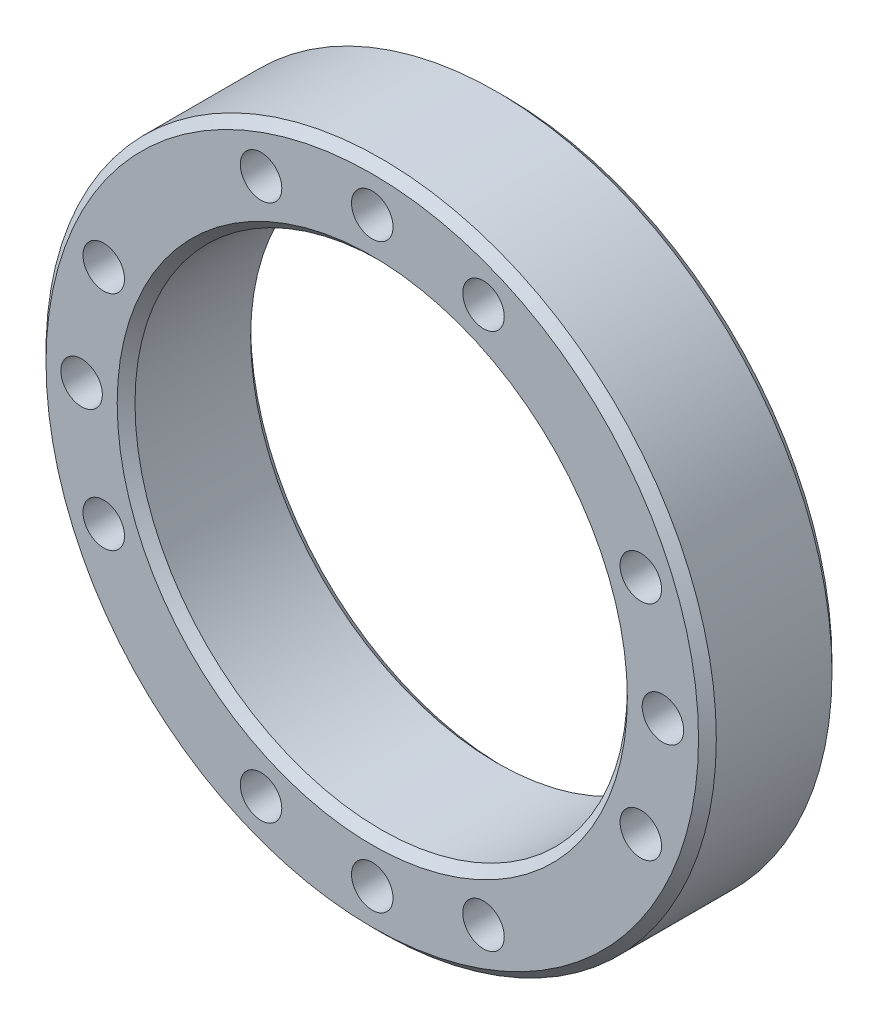
ISO-10303-21;
HEADER;
FILE_DESCRIPTION(('STEP AP214'),'2;1');
FILE_NAME('part.step','',(''),(''),'','','');
FILE_SCHEMA(('AUTOMOTIVE_DESIGN { 1 0 10303 214 1 1 1 1 }'));
ENDSEC;
DATA;
#1=APPLICATION_CONTEXT('core data for automotive mechanical design processes');
#2=APPLICATION_PROTOCOL_DEFINITION('international standard','automotive_design',2000,#1);
#3=PRODUCT_CONTEXT('',#1,'mechanical');
#4=PRODUCT('Part','Part','',(#3));
#5=PRODUCT_RELATED_PRODUCT_CATEGORY('part','',(#4));
#6=PRODUCT_DEFINITION_FORMATION('','',#4);
#7=PRODUCT_DEFINITION_CONTEXT('part definition',#1,'design');
#8=PRODUCT_DEFINITION('design','',#6,#7);
#9=PRODUCT_DEFINITION_SHAPE('','',#8);
#10=(LENGTH_UNIT() NAMED_UNIT(*) SI_UNIT(.MILLI.,.METRE.));
#11=(NAMED_UNIT(*) PLANE_ANGLE_UNIT() SI_UNIT($,.RADIAN.));
#12=(NAMED_UNIT(*) SI_UNIT($,.STERADIAN.) SOLID_ANGLE_UNIT());
#13=UNCERTAINTY_MEASURE_WITH_UNIT(LENGTH_MEASURE(1.E-05),#10,'distance_accuracy_value','');
#14=(GEOMETRIC_REPRESENTATION_CONTEXT(3) GLOBAL_UNCERTAINTY_ASSIGNED_CONTEXT((#13)) GLOBAL_UNIT_ASSIGNED_CONTEXT((#10,
#11,#12)) REPRESENTATION_CONTEXT('',''));
#15=CARTESIAN_POINT('',(0.,0.,0.));
#16=DIRECTION('',(0.,0.,1.));
#17=DIRECTION('',(1.,0.,0.));
#18=AXIS2_PLACEMENT_3D('',#15,#16,#17);
#19=CARTESIAN_POINT('',(0.,0.,22.5));
#20=DIRECTION('',(0.,0.,1.));
#21=DIRECTION('',(1.,0.,0.));
#22=AXIS2_PLACEMENT_3D('',#19,#20,#21);
#23=PLANE('',#22);
#24=CARTESIAN_POINT('',(90.5401941861057,37.5029763717798,22.5));
#25=DIRECTION('',(0.,0.,1.));
#26=DIRECTION('',(1.,0.,0.));
#27=AXIS2_PLACEMENT_3D('',#24,#25,#26);
#28=CIRCLE('',#27,6.99999999999999);
#29=CARTESIAN_POINT('',(97.5401941861057,37.5029763717798,22.5));
#30=VERTEX_POINT('',#29);
#31=EDGE_CURVE('E134',#30,#30,#28,.T.);
#32=ORIENTED_EDGE('',*,*,#31,.F.);
#33=EDGE_LOOP('',(#32));
#34=FACE_BOUND('',#33,.T.);
#35=CARTESIAN_POINT('',(90.5401941861065,-37.5029763717779,22.5));
#36=DIRECTION('',(0.,0.,1.));
#37=DIRECTION('',(1.,0.,0.));
#38=AXIS2_PLACEMENT_3D('',#35,#36,#37);
#39=CIRCLE('',#38,6.99999999999999);
#40=CARTESIAN_POINT('',(97.5401941861065,-37.5029763717779,22.5));
#41=VERTEX_POINT('',#40);
#42=EDGE_CURVE('E128',#41,#41,#39,.T.);
#43=ORIENTED_EDGE('',*,*,#42,.F.);
#44=EDGE_LOOP('',(#43));
#45=FACE_BOUND('',#44,.T.);
#46=CARTESIAN_POINT('',(98.,1.02649551361988E-12,22.5));
#47=DIRECTION('',(0.,0.,1.));
#48=DIRECTION('',(1.,0.,0.));
#49=AXIS2_PLACEMENT_3D('',#46,#47,#48);
#50=CIRCLE('',#49,6.99999999999999);
#51=CARTESIAN_POINT('',(105.,1.02649551361988E-12,22.5));
#52=VERTEX_POINT('',#51);
#53=EDGE_CURVE('E122',#52,#52,#50,.T.);
#54=ORIENTED_EDGE('',*,*,#53,.F.);
#55=EDGE_LOOP('',(#54));
#56=FACE_BOUND('',#55,.T.);
#57=CARTESIAN_POINT('',(37.5029763717789,-90.5401941861061,22.5));
#58=DIRECTION('',(0.,0.,1.));
#59=DIRECTION('',(1.,0.,0.));
#60=AXIS2_PLACEMENT_3D('',#57,#58,#59);
#61=CIRCLE('',#60,6.99999999999999);
#62=CARTESIAN_POINT('',(44.5029763717788,-90.5401941861061,22.5));
#63=VERTEX_POINT('',#62);
#64=EDGE_CURVE('E116',#63,#63,#61,.T.);
#65=ORIENTED_EDGE('',*,*,#64,.F.);
#66=EDGE_LOOP('',(#65));
#67=FACE_BOUND('',#66,.T.);
#68=CARTESIAN_POINT('',(-37.5029763717789,-90.5401941861061,22.5));
#69=DIRECTION('',(0.,0.,1.));
#70=DIRECTION('',(1.,0.,0.));
#71=AXIS2_PLACEMENT_3D('',#68,#69,#70);
#72=CIRCLE('',#71,6.99999999999999);
#73=CARTESIAN_POINT('',(-30.5029763717789,-90.5401941861061,22.5));
#74=VERTEX_POINT('',#73);
#75=EDGE_CURVE('E110',#74,#74,#72,.T.);
#76=ORIENTED_EDGE('',*,*,#75,.F.);
#77=EDGE_LOOP('',(#76));
#78=FACE_BOUND('',#77,.T.);
#79=CARTESIAN_POINT('',(0.,-98.,22.5));
#80=DIRECTION('',(0.,0.,1.));
#81=DIRECTION('',(1.,0.,0.));
#82=AXIS2_PLACEMENT_3D('',#79,#80,#81);
#83=CIRCLE('',#82,6.99999999999999);
#84=CARTESIAN_POINT('',(6.99999999999999,-98.,22.5));
#85=VERTEX_POINT('',#84);
#86=EDGE_CURVE('E104',#85,#85,#83,.T.);
#87=ORIENTED_EDGE('',*,*,#86,.F.);
#88=EDGE_LOOP('',(#87));
#89=FACE_BOUND('',#88,.T.);
#90=CARTESIAN_POINT('',(-90.5401941861059,-37.5029763717792,22.5));
#91=DIRECTION('',(0.,0.,1.));
#92=DIRECTION('',(1.,0.,0.));
#93=AXIS2_PLACEMENT_3D('',#90,#91,#92);
#94=CIRCLE('',#93,6.99999999999999);
#95=CARTESIAN_POINT('',(-83.540194186106,-37.5029763717792,22.5));
#96=VERTEX_POINT('',#95);
#97=EDGE_CURVE('E98',#96,#96,#94,.T.);
#98=ORIENTED_EDGE('',*,*,#97,.F.);
#99=EDGE_LOOP('',(#98));
#100=FACE_BOUND('',#99,.T.);
#101=CARTESIAN_POINT('',(-90.5401941861062,37.5029763717786,22.5));
#102=DIRECTION('',(0.,0.,1.));
#103=DIRECTION('',(1.,0.,0.));
#104=AXIS2_PLACEMENT_3D('',#101,#102,#103);
#105=CIRCLE('',#104,6.99999999999999);
#106=CARTESIAN_POINT('',(-83.5401941861062,37.5029763717786,22.5));
#107=VERTEX_POINT('',#106);
#108=EDGE_CURVE('E92',#107,#107,#105,.T.);
#109=ORIENTED_EDGE('',*,*,#108,.F.);
#110=EDGE_LOOP('',(#109));
#111=FACE_BOUND('',#110,.T.);
#112=CARTESIAN_POINT('',(-98.,-3.42165171206627E-13,22.5));
#113=DIRECTION('',(0.,0.,1.));
#114=DIRECTION('',(1.,0.,0.));
#115=AXIS2_PLACEMENT_3D('',#112,#113,#114);
#116=CIRCLE('',#115,6.99999999999999);
#117=CARTESIAN_POINT('',(-91.,-3.42165171206627E-13,22.5));
#118=VERTEX_POINT('',#117);
#119=EDGE_CURVE('E86',#118,#118,#116,.T.);
#120=ORIENTED_EDGE('',*,*,#119,.F.);
#121=EDGE_LOOP('',(#120));
#122=FACE_BOUND('',#121,.T.);
#123=CARTESIAN_POINT('',(-37.5029763717789,90.5401941861061,22.5));
#124=DIRECTION('',(0.,0.,1.));
#125=DIRECTION('',(1.,0.,0.));
#126=AXIS2_PLACEMENT_3D('',#123,#124,#125);
#127=CIRCLE('',#126,6.99999999999999);
#128=CARTESIAN_POINT('',(-30.5029763717789,90.5401941861061,22.5));
#129=VERTEX_POINT('',#128);
#130=EDGE_CURVE('E80',#129,#129,#127,.T.);
#131=ORIENTED_EDGE('',*,*,#130,.F.);
#132=EDGE_LOOP('',(#131));
#133=FACE_BOUND('',#132,.T.);
#134=CARTESIAN_POINT('',(37.5029763717789,90.5401941861061,22.5));
#135=DIRECTION('',(0.,0.,1.));
#136=DIRECTION('',(1.,0.,0.));
#137=AXIS2_PLACEMENT_3D('',#134,#135,#136);
#138=CIRCLE('',#137,6.99999999999999);
#139=CARTESIAN_POINT('',(44.5029763717789,90.5401941861061,22.5));
#140=VERTEX_POINT('',#139);
#141=EDGE_CURVE('E74',#140,#140,#138,.T.);
#142=ORIENTED_EDGE('',*,*,#141,.F.);
#143=EDGE_LOOP('',(#142));
#144=FACE_BOUND('',#143,.T.);
#145=CARTESIAN_POINT('',(0.,98.,22.5));
#146=DIRECTION('',(0.,0.,1.));
#147=DIRECTION('',(1.,0.,0.));
#148=AXIS2_PLACEMENT_3D('',#145,#146,#147);
#149=CIRCLE('',#148,6.99999999999999);
#150=CARTESIAN_POINT('',(6.99999999999999,98.,22.5));
#151=VERTEX_POINT('',#150);
#152=EDGE_CURVE('E68',#151,#151,#149,.T.);
#153=ORIENTED_EDGE('',*,*,#152,.F.);
#154=EDGE_LOOP('',(#153));
#155=FACE_BOUND('',#154,.T.);
#156=CARTESIAN_POINT('',(0.,0.,22.5));
#157=DIRECTION('',(0.,0.,1.));
#158=DIRECTION('',(1.,0.,0.));
#159=AXIS2_PLACEMENT_3D('',#156,#157,#158);
#160=CIRCLE('',#159,86.0000000000001);
#161=CARTESIAN_POINT('',(86.0000000000001,0.,22.5));
#162=VERTEX_POINT('',#161);
#163=EDGE_CURVE('E44',#162,#162,#160,.F.);
#164=ORIENTED_EDGE('',*,*,#163,.T.);
#165=EDGE_LOOP('',(#164));
#166=FACE_BOUND('',#165,.T.);
#167=CARTESIAN_POINT('',(0.,0.,22.5));
#168=DIRECTION('',(0.,0.,1.));
#169=DIRECTION('',(1.,0.,0.));
#170=AXIS2_PLACEMENT_3D('',#167,#168,#169);
#171=CIRCLE('',#170,110.);
#172=CARTESIAN_POINT('',(110.,0.,22.5));
#173=VERTEX_POINT('',#172);
#174=EDGE_CURVE('E48',#173,#173,#171,.T.);
#175=ORIENTED_EDGE('',*,*,#174,.T.);
#176=EDGE_LOOP('',(#175));
#177=FACE_BOUND('',#176,.T.);
#178=ADVANCED_FACE('F33',(#34,#45,#56,#67,#78,#89,#100,#111,#122,#133,#144,#155,#166,#177),#23,.T.);
#179=CARTESIAN_POINT('',(0.,0.,-22.5));
#180=DIRECTION('',(0.,0.,1.));
#181=DIRECTION('',(1.,0.,0.));
#182=AXIS2_PLACEMENT_3D('',#179,#180,#181);
#183=PLANE('',#182);
#184=CARTESIAN_POINT('',(90.5401941861057,37.5029763717798,-22.5));
#185=DIRECTION('',(0.,0.,1.));
#186=DIRECTION('',(1.,0.,0.));
#187=AXIS2_PLACEMENT_3D('',#184,#185,#186);
#188=CIRCLE('',#187,6.99999999999999);
#189=CARTESIAN_POINT('',(97.5401941861057,37.5029763717798,-22.5));
#190=VERTEX_POINT('',#189);
#191=EDGE_CURVE('E131',#190,#190,#188,.T.);
#192=ORIENTED_EDGE('',*,*,#191,.T.);
#193=EDGE_LOOP('',(#192));
#194=FACE_BOUND('',#193,.T.);
#195=CARTESIAN_POINT('',(90.5401941861065,-37.5029763717779,-22.5));
#196=DIRECTION('',(0.,0.,1.));
#197=DIRECTION('',(1.,0.,0.));
#198=AXIS2_PLACEMENT_3D('',#195,#196,#197);
#199=CIRCLE('',#198,6.99999999999999);
#200=CARTESIAN_POINT('',(97.5401941861065,-37.5029763717779,-22.5));
#201=VERTEX_POINT('',#200);
#202=EDGE_CURVE('E125',#201,#201,#199,.T.);
#203=ORIENTED_EDGE('',*,*,#202,.T.);
#204=EDGE_LOOP('',(#203));
#205=FACE_BOUND('',#204,.T.);
#206=CARTESIAN_POINT('',(98.,1.02649551361988E-12,-22.5));
#207=DIRECTION('',(0.,0.,1.));
#208=DIRECTION('',(1.,0.,0.));
#209=AXIS2_PLACEMENT_3D('',#206,#207,#208);
#210=CIRCLE('',#209,6.99999999999999);
#211=CARTESIAN_POINT('',(105.,1.02649551361988E-12,-22.5));
#212=VERTEX_POINT('',#211);
#213=EDGE_CURVE('E119',#212,#212,#210,.T.);
#214=ORIENTED_EDGE('',*,*,#213,.T.);
#215=EDGE_LOOP('',(#214));
#216=FACE_BOUND('',#215,.T.);
#217=CARTESIAN_POINT('',(37.5029763717789,-90.5401941861061,-22.5));
#218=DIRECTION('',(0.,0.,1.));
#219=DIRECTION('',(1.,0.,0.));
#220=AXIS2_PLACEMENT_3D('',#217,#218,#219);
#221=CIRCLE('',#220,6.99999999999999);
#222=CARTESIAN_POINT('',(44.5029763717788,-90.5401941861061,-22.5));
#223=VERTEX_POINT('',#222);
#224=EDGE_CURVE('E113',#223,#223,#221,.T.);
#225=ORIENTED_EDGE('',*,*,#224,.T.);
#226=EDGE_LOOP('',(#225));
#227=FACE_BOUND('',#226,.T.);
#228=CARTESIAN_POINT('',(-37.5029763717789,-90.5401941861061,-22.5));
#229=DIRECTION('',(0.,0.,1.));
#230=DIRECTION('',(1.,0.,0.));
#231=AXIS2_PLACEMENT_3D('',#228,#229,#230);
#232=CIRCLE('',#231,6.99999999999999);
#233=CARTESIAN_POINT('',(-30.5029763717789,-90.5401941861061,-22.5));
#234=VERTEX_POINT('',#233);
#235=EDGE_CURVE('E107',#234,#234,#232,.T.);
#236=ORIENTED_EDGE('',*,*,#235,.T.);
#237=EDGE_LOOP('',(#236));
#238=FACE_BOUND('',#237,.T.);
#239=CARTESIAN_POINT('',(0.,-98.,-22.5));
#240=DIRECTION('',(0.,0.,1.));
#241=DIRECTION('',(1.,0.,0.));
#242=AXIS2_PLACEMENT_3D('',#239,#240,#241);
#243=CIRCLE('',#242,6.99999999999999);
#244=CARTESIAN_POINT('',(6.99999999999999,-98.,-22.5));
#245=VERTEX_POINT('',#244);
#246=EDGE_CURVE('E101',#245,#245,#243,.T.);
#247=ORIENTED_EDGE('',*,*,#246,.T.);
#248=EDGE_LOOP('',(#247));
#249=FACE_BOUND('',#248,.T.);
#250=CARTESIAN_POINT('',(-90.5401941861059,-37.5029763717792,-22.5));
#251=DIRECTION('',(0.,0.,1.));
#252=DIRECTION('',(1.,0.,0.));
#253=AXIS2_PLACEMENT_3D('',#250,#251,#252);
#254=CIRCLE('',#253,6.99999999999999);
#255=CARTESIAN_POINT('',(-83.540194186106,-37.5029763717792,-22.5));
#256=VERTEX_POINT('',#255);
#257=EDGE_CURVE('E95',#256,#256,#254,.T.);
#258=ORIENTED_EDGE('',*,*,#257,.T.);
#259=EDGE_LOOP('',(#258));
#260=FACE_BOUND('',#259,.T.);
#261=CARTESIAN_POINT('',(-90.5401941861062,37.5029763717786,-22.5));
#262=DIRECTION('',(0.,0.,1.));
#263=DIRECTION('',(1.,0.,0.));
#264=AXIS2_PLACEMENT_3D('',#261,#262,#263);
#265=CIRCLE('',#264,6.99999999999999);
#266=CARTESIAN_POINT('',(-83.5401941861062,37.5029763717786,-22.5));
#267=VERTEX_POINT('',#266);
#268=EDGE_CURVE('E89',#267,#267,#265,.T.);
#269=ORIENTED_EDGE('',*,*,#268,.T.);
#270=EDGE_LOOP('',(#269));
#271=FACE_BOUND('',#270,.T.);
#272=CARTESIAN_POINT('',(-98.,-3.42165171206627E-13,-22.5));
#273=DIRECTION('',(0.,0.,1.));
#274=DIRECTION('',(1.,0.,0.));
#275=AXIS2_PLACEMENT_3D('',#272,#273,#274);
#276=CIRCLE('',#275,6.99999999999999);
#277=CARTESIAN_POINT('',(-91.,-3.42165171206627E-13,-22.5));
#278=VERTEX_POINT('',#277);
#279=EDGE_CURVE('E83',#278,#278,#276,.T.);
#280=ORIENTED_EDGE('',*,*,#279,.T.);
#281=EDGE_LOOP('',(#280));
#282=FACE_BOUND('',#281,.T.);
#283=CARTESIAN_POINT('',(-37.5029763717789,90.5401941861061,-22.5));
#284=DIRECTION('',(0.,0.,1.));
#285=DIRECTION('',(1.,0.,0.));
#286=AXIS2_PLACEMENT_3D('',#283,#284,#285);
#287=CIRCLE('',#286,6.99999999999999);
#288=CARTESIAN_POINT('',(-30.5029763717789,90.5401941861061,-22.5));
#289=VERTEX_POINT('',#288);
#290=EDGE_CURVE('E77',#289,#289,#287,.T.);
#291=ORIENTED_EDGE('',*,*,#290,.T.);
#292=EDGE_LOOP('',(#291));
#293=FACE_BOUND('',#292,.T.);
#294=CARTESIAN_POINT('',(37.5029763717789,90.5401941861061,-22.5));
#295=DIRECTION('',(0.,0.,1.));
#296=DIRECTION('',(1.,0.,0.));
#297=AXIS2_PLACEMENT_3D('',#294,#295,#296);
#298=CIRCLE('',#297,6.99999999999999);
#299=CARTESIAN_POINT('',(44.5029763717789,90.5401941861061,-22.5));
#300=VERTEX_POINT('',#299);
#301=EDGE_CURVE('E71',#300,#300,#298,.T.);
#302=ORIENTED_EDGE('',*,*,#301,.T.);
#303=EDGE_LOOP('',(#302));
#304=FACE_BOUND('',#303,.T.);
#305=CARTESIAN_POINT('',(0.,98.,-22.5));
#306=DIRECTION('',(0.,0.,1.));
#307=DIRECTION('',(1.,0.,0.));
#308=AXIS2_PLACEMENT_3D('',#305,#306,#307);
#309=CIRCLE('',#308,6.99999999999999);
#310=CARTESIAN_POINT('',(6.99999999999999,98.,-22.5));
#311=VERTEX_POINT('',#310);
#312=EDGE_CURVE('E65',#311,#311,#309,.T.);
#313=ORIENTED_EDGE('',*,*,#312,.T.);
#314=EDGE_LOOP('',(#313));
#315=FACE_BOUND('',#314,.T.);
#316=CARTESIAN_POINT('',(0.,0.,-22.5));
#317=DIRECTION('',(0.,0.,1.));
#318=DIRECTION('',(1.,0.,0.));
#319=AXIS2_PLACEMENT_3D('',#316,#317,#318);
#320=CIRCLE('',#319,85.9999999999999);
#321=CARTESIAN_POINT('',(85.9999999999999,0.,-22.5));
#322=VERTEX_POINT('',#321);
#323=EDGE_CURVE('E59',#322,#322,#320,.T.);
#324=ORIENTED_EDGE('',*,*,#323,.T.);
#325=EDGE_LOOP('',(#324));
#326=FACE_BOUND('',#325,.T.);
#327=CARTESIAN_POINT('',(0.,0.,-22.5));
#328=DIRECTION('',(0.,0.,1.));
#329=DIRECTION('',(1.,0.,0.));
#330=AXIS2_PLACEMENT_3D('',#327,#328,#329);
#331=CIRCLE('',#330,110.);
#332=CARTESIAN_POINT('',(110.,0.,-22.5));
#333=VERTEX_POINT('',#332);
#334=EDGE_CURVE('E62',#333,#333,#331,.F.);
#335=ORIENTED_EDGE('',*,*,#334,.T.);
#336=EDGE_LOOP('',(#335));
#337=FACE_BOUND('',#336,.T.);
#338=ADVANCED_FACE('F142',(#194,#205,#216,#227,#238,#249,#260,#271,#282,#293,#304,#315,#326,
#337),#183,.F.);
#339=CARTESIAN_POINT('',(0.,0.,22.5));
#340=DIRECTION('',(0.,0.,-1.));
#341=DIRECTION('',(-1.,0.,0.));
#342=AXIS2_PLACEMENT_3D('',#339,#340,#341);
#343=CYLINDRICAL_SURFACE('',#342,113.);
#344=CARTESIAN_POINT('',(0.,0.,-19.4999999999998));
#345=DIRECTION('',(0.,0.,1.));
#346=DIRECTION('',(1.,0.,0.));
#347=AXIS2_PLACEMENT_3D('',#344,#345,#346);
#348=CIRCLE('',#347,113.);
#349=CARTESIAN_POINT('',(113.,0.,-19.4999999999998));
#350=VERTEX_POINT('',#349);
#351=EDGE_CURVE('E10',#350,#350,#348,.T.);
#352=ORIENTED_EDGE('',*,*,#351,.T.);
#353=EDGE_LOOP('',(#352));
#354=FACE_BOUND('',#353,.T.);
#355=CARTESIAN_POINT('',(0.,0.,19.5000000000001));
#356=DIRECTION('',(0.,0.,1.));
#357=DIRECTION('',(1.,0.,0.));
#358=AXIS2_PLACEMENT_3D('',#355,#356,#357);
#359=CIRCLE('',#358,113.);
#360=CARTESIAN_POINT('',(113.,0.,19.5000000000001));
#361=VERTEX_POINT('',#360);
#362=EDGE_CURVE('E40',#361,#361,#359,.F.);
#363=ORIENTED_EDGE('',*,*,#362,.T.);
#364=EDGE_LOOP('',(#363));
#365=FACE_BOUND('',#364,.T.);
#366=ADVANCED_FACE('F196',(#354,#365),#343,.T.);
#367=CARTESIAN_POINT('',(0.,0.,22.5));
#368=DIRECTION('',(0.,0.,-1.));
#369=DIRECTION('',(-1.,0.,0.));
#370=AXIS2_PLACEMENT_3D('',#367,#368,#369);
#371=CYLINDRICAL_SURFACE('',#370,83.);
#372=CARTESIAN_POINT('',(0.,0.,-19.5000000000001));
#373=DIRECTION('',(0.,0.,1.));
#374=DIRECTION('',(1.,0.,0.));
#375=AXIS2_PLACEMENT_3D('',#372,#373,#374);
#376=CIRCLE('',#375,83.);
#377=CARTESIAN_POINT('',(83.,0.,-19.5000000000001));
#378=VERTEX_POINT('',#377);
#379=EDGE_CURVE('E53',#378,#378,#376,.F.);
#380=ORIENTED_EDGE('',*,*,#379,.T.);
#381=EDGE_LOOP('',(#380));
#382=FACE_BOUND('',#381,.T.);
#383=CARTESIAN_POINT('',(0.,0.,19.4999999999999));
#384=DIRECTION('',(0.,0.,1.));
#385=DIRECTION('',(1.,0.,0.));
#386=AXIS2_PLACEMENT_3D('',#383,#384,#385);
#387=CIRCLE('',#386,83.);
#388=CARTESIAN_POINT('',(83.,0.,19.4999999999999));
#389=VERTEX_POINT('',#388);
#390=EDGE_CURVE('E56',#389,#389,#387,.T.);
#391=ORIENTED_EDGE('',*,*,#390,.T.);
#392=EDGE_LOOP('',(#391));
#393=FACE_BOUND('',#392,.T.);
#394=ADVANCED_FACE('F194',(#382,#393),#371,.F.);
#395=CARTESIAN_POINT('',(0.,0.,-22.5));
#396=DIRECTION('',(0.,0.,-1.));
#397=DIRECTION('',(-1.,0.,0.));
#398=AXIS2_PLACEMENT_3D('',#395,#396,#397);
#399=CONICAL_SURFACE('',#398,85.9999999999999,0.785398163397448);
#400=ORIENTED_EDGE('',*,*,#379,.F.);
#401=EDGE_LOOP('',(#400));
#402=FACE_BOUND('',#401,.T.);
#403=ORIENTED_EDGE('',*,*,#323,.F.);
#404=EDGE_LOOP('',(#403));
#405=FACE_BOUND('',#404,.T.);
#406=ADVANCED_FACE('F186',(#402,#405),#399,.F.);
#407=CARTESIAN_POINT('',(0.,0.,19.4999999999999));
#408=DIRECTION('',(0.,0.,1.));
#409=DIRECTION('',(1.,0.,0.));
#410=AXIS2_PLACEMENT_3D('',#407,#408,#409);
#411=CONICAL_SURFACE('',#410,83.,0.785398163397444);
#412=ORIENTED_EDGE('',*,*,#163,.F.);
#413=EDGE_LOOP('',(#412));
#414=FACE_BOUND('',#413,.T.);
#415=ORIENTED_EDGE('',*,*,#390,.F.);
#416=EDGE_LOOP('',(#415));
#417=FACE_BOUND('',#416,.T.);
#418=ADVANCED_FACE('F181',(#414,#417),#411,.F.);
#419=CARTESIAN_POINT('',(0.,0.,-19.4999999999998));
#420=DIRECTION('',(0.,0.,1.));
#421=DIRECTION('',(1.,0.,0.));
#422=AXIS2_PLACEMENT_3D('',#419,#420,#421);
#423=CONICAL_SURFACE('',#422,113.,0.785398163397448);
#424=ORIENTED_EDGE('',*,*,#334,.F.);
#425=EDGE_LOOP('',(#424));
#426=FACE_BOUND('',#425,.T.);
#427=ORIENTED_EDGE('',*,*,#351,.F.);
#428=EDGE_LOOP('',(#427));
#429=FACE_BOUND('',#428,.T.);
#430=ADVANCED_FACE('F172',(#426,#429),#423,.T.);
#431=CARTESIAN_POINT('',(0.,0.,22.5));
#432=DIRECTION('',(0.,0.,-1.));
#433=DIRECTION('',(-1.,0.,0.));
#434=AXIS2_PLACEMENT_3D('',#431,#432,#433);
#435=CONICAL_SURFACE('',#434,110.,0.785398163397448);
#436=ORIENTED_EDGE('',*,*,#362,.F.);
#437=EDGE_LOOP('',(#436));
#438=FACE_BOUND('',#437,.T.);
#439=ORIENTED_EDGE('',*,*,#174,.F.);
#440=EDGE_LOOP('',(#439));
#441=FACE_BOUND('',#440,.T.);
#442=ADVANCED_FACE('F35',(#438,#441),#435,.T.);
#443=CARTESIAN_POINT('',(0.,98.,22.5));
#444=DIRECTION('',(0.,0.,1.));
#445=DIRECTION('',(1.,0.,0.));
#446=AXIS2_PLACEMENT_3D('',#443,#444,#445);
#447=CYLINDRICAL_SURFACE('',#446,6.99999999999999);
#448=ORIENTED_EDGE('',*,*,#312,.F.);
#449=EDGE_LOOP('',(#448));
#450=FACE_BOUND('',#449,.T.);
#451=ORIENTED_EDGE('',*,*,#152,.T.);
#452=EDGE_LOOP('',(#451));
#453=FACE_BOUND('',#452,.T.);
#454=ADVANCED_FACE('F171',(#450,#453),#447,.F.);
#455=CARTESIAN_POINT('',(37.5029763717789,90.5401941861061,22.5));
#456=DIRECTION('',(0.,0.,1.));
#457=DIRECTION('',(1.,0.,0.));
#458=AXIS2_PLACEMENT_3D('',#455,#456,#457);
#459=CYLINDRICAL_SURFACE('',#458,6.99999999999999);
#460=ORIENTED_EDGE('',*,*,#301,.F.);
#461=EDGE_LOOP('',(#460));
#462=FACE_BOUND('',#461,.T.);
#463=ORIENTED_EDGE('',*,*,#141,.T.);
#464=EDGE_LOOP('',(#463));
#465=FACE_BOUND('',#464,.T.);
#466=ADVANCED_FACE('F178',(#462,#465),#459,.F.);
#467=CARTESIAN_POINT('',(-37.5029763717789,90.5401941861061,22.5));
#468=DIRECTION('',(0.,0.,1.));
#469=DIRECTION('',(1.,0.,0.));
#470=AXIS2_PLACEMENT_3D('',#467,#468,#469);
#471=CYLINDRICAL_SURFACE('',#470,6.99999999999999);
#472=ORIENTED_EDGE('',*,*,#290,.F.);
#473=EDGE_LOOP('',(#472));
#474=FACE_BOUND('',#473,.T.);
#475=ORIENTED_EDGE('',*,*,#130,.T.);
#476=EDGE_LOOP('',(#475));
#477=FACE_BOUND('',#476,.T.);
#478=ADVANCED_FACE('F207',(#474,#477),#471,.F.);
#479=CARTESIAN_POINT('',(-98.,-3.42165171206627E-13,22.5));
#480=DIRECTION('',(0.,0.,1.));
#481=DIRECTION('',(1.,0.,0.));
#482=AXIS2_PLACEMENT_3D('',#479,#480,#481);
#483=CYLINDRICAL_SURFACE('',#482,6.99999999999999);
#484=ORIENTED_EDGE('',*,*,#279,.F.);
#485=EDGE_LOOP('',(#484));
#486=FACE_BOUND('',#485,.T.);
#487=ORIENTED_EDGE('',*,*,#119,.T.);
#488=EDGE_LOOP('',(#487));
#489=FACE_BOUND('',#488,.T.);
#490=ADVANCED_FACE('F211',(#486,#489),#483,.F.);
#491=CARTESIAN_POINT('',(-90.5401941861062,37.5029763717786,22.5));
#492=DIRECTION('',(0.,0.,1.));
#493=DIRECTION('',(1.,0.,0.));
#494=AXIS2_PLACEMENT_3D('',#491,#492,#493);
#495=CYLINDRICAL_SURFACE('',#494,6.99999999999999);
#496=ORIENTED_EDGE('',*,*,#268,.F.);
#497=EDGE_LOOP('',(#496));
#498=FACE_BOUND('',#497,.T.);
#499=ORIENTED_EDGE('',*,*,#108,.T.);
#500=EDGE_LOOP('',(#499));
#501=FACE_BOUND('',#500,.T.);
#502=ADVANCED_FACE('F215',(#498,#501),#495,.F.);
#503=CARTESIAN_POINT('',(-90.5401941861059,-37.5029763717792,22.5));
#504=DIRECTION('',(0.,0.,1.));
#505=DIRECTION('',(1.,0.,0.));
#506=AXIS2_PLACEMENT_3D('',#503,#504,#505);
#507=CYLINDRICAL_SURFACE('',#506,6.99999999999999);
#508=ORIENTED_EDGE('',*,*,#257,.F.);
#509=EDGE_LOOP('',(#508));
#510=FACE_BOUND('',#509,.T.);
#511=ORIENTED_EDGE('',*,*,#97,.T.);
#512=EDGE_LOOP('',(#511));
#513=FACE_BOUND('',#512,.T.);
#514=ADVANCED_FACE('F219',(#510,#513),#507,.F.);
#515=CARTESIAN_POINT('',(0.,-98.,22.5));
#516=DIRECTION('',(0.,0.,1.));
#517=DIRECTION('',(1.,0.,0.));
#518=AXIS2_PLACEMENT_3D('',#515,#516,#517);
#519=CYLINDRICAL_SURFACE('',#518,6.99999999999999);
#520=ORIENTED_EDGE('',*,*,#246,.F.);
#521=EDGE_LOOP('',(#520));
#522=FACE_BOUND('',#521,.T.);
#523=ORIENTED_EDGE('',*,*,#86,.T.);
#524=EDGE_LOOP('',(#523));
#525=FACE_BOUND('',#524,.T.);
#526=ADVANCED_FACE('F223',(#522,#525),#519,.F.);
#527=CARTESIAN_POINT('',(-37.5029763717789,-90.5401941861061,22.5));
#528=DIRECTION('',(0.,0.,1.));
#529=DIRECTION('',(1.,0.,0.));
#530=AXIS2_PLACEMENT_3D('',#527,#528,#529);
#531=CYLINDRICAL_SURFACE('',#530,6.99999999999999);
#532=ORIENTED_EDGE('',*,*,#235,.F.);
#533=EDGE_LOOP('',(#532));
#534=FACE_BOUND('',#533,.T.);
#535=ORIENTED_EDGE('',*,*,#75,.T.);
#536=EDGE_LOOP('',(#535));
#537=FACE_BOUND('',#536,.T.);
#538=ADVANCED_FACE('F227',(#534,#537),#531,.F.);
#539=CARTESIAN_POINT('',(37.5029763717789,-90.5401941861061,22.5));
#540=DIRECTION('',(0.,0.,1.));
#541=DIRECTION('',(1.,0.,0.));
#542=AXIS2_PLACEMENT_3D('',#539,#540,#541);
#543=CYLINDRICAL_SURFACE('',#542,6.99999999999999);
#544=ORIENTED_EDGE('',*,*,#224,.F.);
#545=EDGE_LOOP('',(#544));
#546=FACE_BOUND('',#545,.T.);
#547=ORIENTED_EDGE('',*,*,#64,.T.);
#548=EDGE_LOOP('',(#547));
#549=FACE_BOUND('',#548,.T.);
#550=ADVANCED_FACE('F231',(#546,#549),#543,.F.);
#551=CARTESIAN_POINT('',(98.,1.02649551361988E-12,22.5));
#552=DIRECTION('',(0.,0.,1.));
#553=DIRECTION('',(1.,0.,0.));
#554=AXIS2_PLACEMENT_3D('',#551,#552,#553);
#555=CYLINDRICAL_SURFACE('',#554,6.99999999999999);
#556=ORIENTED_EDGE('',*,*,#213,.F.);
#557=EDGE_LOOP('',(#556));
#558=FACE_BOUND('',#557,.T.);
#559=ORIENTED_EDGE('',*,*,#53,.T.);
#560=EDGE_LOOP('',(#559));
#561=FACE_BOUND('',#560,.T.);
#562=ADVANCED_FACE('F235',(#558,#561),#555,.F.);
#563=CARTESIAN_POINT('',(90.5401941861065,-37.5029763717779,22.5));
#564=DIRECTION('',(0.,0.,1.));
#565=DIRECTION('',(1.,0.,0.));
#566=AXIS2_PLACEMENT_3D('',#563,#564,#565);
#567=CYLINDRICAL_SURFACE('',#566,6.99999999999999);
#568=ORIENTED_EDGE('',*,*,#202,.F.);
#569=EDGE_LOOP('',(#568));
#570=FACE_BOUND('',#569,.T.);
#571=ORIENTED_EDGE('',*,*,#42,.T.);
#572=EDGE_LOOP('',(#571));
#573=FACE_BOUND('',#572,.T.);
#574=ADVANCED_FACE('F239',(#570,#573),#567,.F.);
#575=CARTESIAN_POINT('',(90.5401941861057,37.5029763717798,22.5));
#576=DIRECTION('',(0.,0.,1.));
#577=DIRECTION('',(1.,0.,0.));
#578=AXIS2_PLACEMENT_3D('',#575,#576,#577);
#579=CYLINDRICAL_SURFACE('',#578,6.99999999999999);
#580=ORIENTED_EDGE('',*,*,#191,.F.);
#581=EDGE_LOOP('',(#580));
#582=FACE_BOUND('',#581,.T.);
#583=ORIENTED_EDGE('',*,*,#31,.T.);
#584=EDGE_LOOP('',(#583));
#585=FACE_BOUND('',#584,.T.);
#586=ADVANCED_FACE('F138',(#582,#585),#579,.F.);
#587=CLOSED_SHELL('',(#178,#338,#366,#394,#406,#418,#430,#442,#454,#466,#478,#490,#502,#514,
#526,#538,#550,#562,#574,#586));
#588=MANIFOLD_SOLID_BREP('B2',#587);
#589=ADVANCED_BREP_SHAPE_REPRESENTATION('',(#18,#588),#14);
#590=SHAPE_DEFINITION_REPRESENTATION(#9,#589);
ENDSEC;
END-ISO-10303-21;
